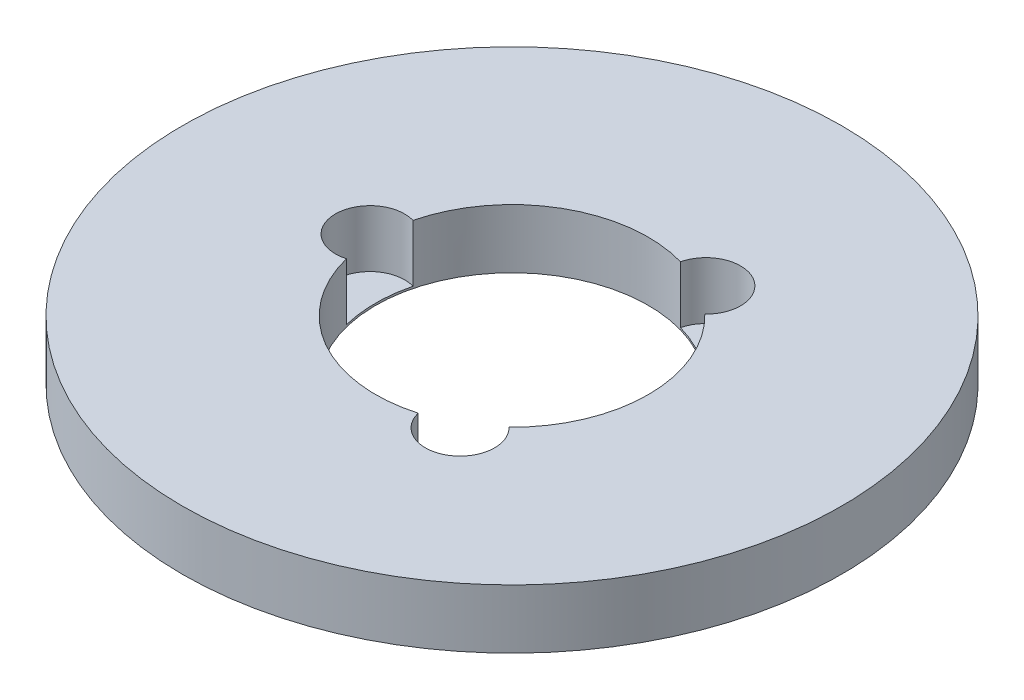
ISO-10303-21;
HEADER;
FILE_DESCRIPTION(('STEP AP214'),'2;1');
FILE_NAME('part.step','',(''),(''),'','','');
FILE_SCHEMA(('AUTOMOTIVE_DESIGN { 1 0 10303 214 1 1 1 1 }'));
ENDSEC;
DATA;
#1=APPLICATION_CONTEXT('core data for automotive mechanical design processes');
#2=APPLICATION_PROTOCOL_DEFINITION('international standard','automotive_design',2000,#1);
#3=PRODUCT_CONTEXT('',#1,'mechanical');
#4=PRODUCT('Part','Part','',(#3));
#5=PRODUCT_RELATED_PRODUCT_CATEGORY('part','',(#4));
#6=PRODUCT_DEFINITION_FORMATION('','',#4);
#7=PRODUCT_DEFINITION_CONTEXT('part definition',#1,'design');
#8=PRODUCT_DEFINITION('design','',#6,#7);
#9=PRODUCT_DEFINITION_SHAPE('','',#8);
#10=(LENGTH_UNIT() NAMED_UNIT(*) SI_UNIT(.MILLI.,.METRE.));
#11=(NAMED_UNIT(*) PLANE_ANGLE_UNIT() SI_UNIT($,.RADIAN.));
#12=(NAMED_UNIT(*) SI_UNIT($,.STERADIAN.) SOLID_ANGLE_UNIT());
#13=UNCERTAINTY_MEASURE_WITH_UNIT(LENGTH_MEASURE(1.E-05),#10,'distance_accuracy_value','');
#14=(GEOMETRIC_REPRESENTATION_CONTEXT(3) GLOBAL_UNCERTAINTY_ASSIGNED_CONTEXT((#13)) GLOBAL_UNIT_ASSIGNED_CONTEXT((#10,
#11,#12)) REPRESENTATION_CONTEXT('',''));
#15=CARTESIAN_POINT('',(0.,0.,0.));
#16=DIRECTION('',(0.,0.,1.));
#17=DIRECTION('',(1.,0.,0.));
#18=AXIS2_PLACEMENT_3D('',#15,#16,#17);
#19=CARTESIAN_POINT('',(0.,13.,0.));
#20=DIRECTION('',(0.,-1.,0.));
#21=DIRECTION('',(0.,0.,-1.));
#22=AXIS2_PLACEMENT_3D('',#19,#20,#21);
#23=CYLINDRICAL_SURFACE('',#22,72.5);
#24=CARTESIAN_POINT('',(0.,13.,0.));
#25=DIRECTION('',(0.,1.,0.));
#26=DIRECTION('',(0.,0.,1.));
#27=AXIS2_PLACEMENT_3D('',#24,#25,#26);
#28=CIRCLE('',#27,72.5);
#29=CARTESIAN_POINT('',(0.,13.,-72.5));
#30=VERTEX_POINT('',#29);
#31=EDGE_CURVE('E126',#30,#30,#28,.T.);
#32=CARTESIAN_POINT('',(0.,0.,0.));
#33=DIRECTION('',(0.,1.,0.));
#34=DIRECTION('',(0.,0.,1.));
#35=AXIS2_PLACEMENT_3D('',#32,#33,#34);
#36=CIRCLE('',#35,72.5);
#37=CARTESIAN_POINT('',(0.,0.,-72.5));
#38=VERTEX_POINT('',#37);
#39=EDGE_CURVE('E124',#38,#38,#36,.T.);
#40=CARTESIAN_POINT('',(0.,13.,-72.5));
#41=CARTESIAN_POINT('',(0.,12.8645833333333,-72.5));
#42=CARTESIAN_POINT('',(0.,12.7291666666667,-72.5));
#43=CARTESIAN_POINT('',(0.,12.4583333333333,-72.5));
#44=CARTESIAN_POINT('',(0.,12.3229166666667,-72.5));
#45=CARTESIAN_POINT('',(0.,12.0520833333333,-72.5));
#46=CARTESIAN_POINT('',(0.,11.9166666666667,-72.5));
#47=CARTESIAN_POINT('',(0.,11.6458333333333,-72.5));
#48=CARTESIAN_POINT('',(0.,11.5104166666667,-72.5));
#49=CARTESIAN_POINT('',(0.,11.2395833333333,-72.5));
#50=CARTESIAN_POINT('',(0.,11.1041666666667,-72.5));
#51=CARTESIAN_POINT('',(0.,10.8333333333333,-72.5));
#52=CARTESIAN_POINT('',(0.,10.6979166666667,-72.5));
#53=CARTESIAN_POINT('',(0.,10.4270833333333,-72.5));
#54=CARTESIAN_POINT('',(0.,10.2916666666667,-72.5));
#55=CARTESIAN_POINT('',(0.,10.0208333333333,-72.5));
#56=CARTESIAN_POINT('',(0.,9.88541666666667,-72.5));
#57=CARTESIAN_POINT('',(0.,9.61458333333333,-72.5));
#58=CARTESIAN_POINT('',(0.,9.47916666666667,-72.5));
#59=CARTESIAN_POINT('',(0.,9.20833333333333,-72.5));
#60=CARTESIAN_POINT('',(0.,9.07291666666666,-72.5));
#61=CARTESIAN_POINT('',(0.,8.80208333333333,-72.5));
#62=CARTESIAN_POINT('',(0.,8.66666666666667,-72.5));
#63=CARTESIAN_POINT('',(0.,8.39583333333333,-72.5));
#64=CARTESIAN_POINT('',(0.,8.26041666666667,-72.5));
#65=CARTESIAN_POINT('',(0.,7.98958333333333,-72.5));
#66=CARTESIAN_POINT('',(0.,7.85416666666667,-72.5));
#67=CARTESIAN_POINT('',(0.,7.58333333333333,-72.5));
#68=CARTESIAN_POINT('',(0.,7.44791666666667,-72.5));
#69=CARTESIAN_POINT('',(0.,7.17708333333333,-72.5));
#70=CARTESIAN_POINT('',(0.,7.04166666666667,-72.5));
#71=CARTESIAN_POINT('',(0.,6.77083333333333,-72.5));
#72=CARTESIAN_POINT('',(0.,6.63541666666667,-72.5));
#73=CARTESIAN_POINT('',(0.,6.36458333333333,-72.5));
#74=CARTESIAN_POINT('',(0.,6.22916666666667,-72.5));
#75=CARTESIAN_POINT('',(0.,5.95833333333333,-72.5));
#76=CARTESIAN_POINT('',(0.,5.82291666666667,-72.5));
#77=CARTESIAN_POINT('',(0.,5.55208333333333,-72.5));
#78=CARTESIAN_POINT('',(0.,5.41666666666667,-72.5));
#79=CARTESIAN_POINT('',(0.,5.14583333333333,-72.5));
#80=CARTESIAN_POINT('',(0.,5.01041666666667,-72.5));
#81=CARTESIAN_POINT('',(0.,4.73958333333333,-72.5));
#82=CARTESIAN_POINT('',(0.,4.60416666666667,-72.5));
#83=CARTESIAN_POINT('',(0.,4.33333333333333,-72.5));
#84=CARTESIAN_POINT('',(0.,4.19791666666667,-72.5));
#85=CARTESIAN_POINT('',(0.,3.92708333333333,-72.5));
#86=CARTESIAN_POINT('',(0.,3.79166666666667,-72.5));
#87=CARTESIAN_POINT('',(0.,3.52083333333333,-72.5));
#88=CARTESIAN_POINT('',(0.,3.38541666666667,-72.5));
#89=CARTESIAN_POINT('',(0.,3.11458333333333,-72.5));
#90=CARTESIAN_POINT('',(0.,2.97916666666667,-72.5));
#91=CARTESIAN_POINT('',(0.,2.70833333333333,-72.5));
#92=CARTESIAN_POINT('',(0.,2.57291666666667,-72.5));
#93=CARTESIAN_POINT('',(0.,2.30208333333333,-72.5));
#94=CARTESIAN_POINT('',(0.,2.16666666666667,-72.5));
#95=CARTESIAN_POINT('',(0.,1.89583333333333,-72.5));
#96=CARTESIAN_POINT('',(0.,1.76041666666667,-72.5));
#97=CARTESIAN_POINT('',(0.,1.48958333333333,-72.5));
#98=CARTESIAN_POINT('',(0.,1.35416666666667,-72.5));
#99=CARTESIAN_POINT('',(0.,1.08333333333333,-72.5));
#100=CARTESIAN_POINT('',(0.,0.947916666666667,-72.5));
#101=CARTESIAN_POINT('',(0.,0.677083333333334,-72.5));
#102=CARTESIAN_POINT('',(0.,0.541666666666667,-72.5));
#103=CARTESIAN_POINT('',(0.,0.270833333333334,-72.5));
#104=CARTESIAN_POINT('',(0.,0.135416666666667,-72.5));
#105=CARTESIAN_POINT('',(0.,0.,-72.5));
#106=B_SPLINE_CURVE_WITH_KNOTS('',3,(#40,#41,#42,#43,#44,#45,#46,#47,#48,#49,#50,#51,#52,#53,
#54,#55,#56,#57,#58,#59,#60,#61,#62,#63,#64,#65,#66,#67,#68,#69,#70,#71,#72,#73,#74,#75,#76,#77,
#78,#79,#80,#81,#82,#83,#84,#85,#86,#87,#88,#89,#90,#91,#92,#93,#94,#95,#96,#97,#98,#99,#100,
#101,#102,#103,#104,#105),.UNSPECIFIED.,.F.,.F.,(4,2,2,2,2,2,2,2,2,2,2,2,2,2,2,2,2,2,2,2,2,2,2,
2,2,2,2,2,2,2,2,2,4),(0.,0.40625,0.812500000000001,1.21875,1.625,2.03125,2.4375,2.84375,3.25,
3.65625,4.0625,4.46875,4.875,5.28125,5.6875,6.09375,6.5,6.90625,7.3125,7.71875,8.125,8.53125,
8.9375,9.34375,9.75,10.15625,10.5625,10.96875,11.375,11.78125,12.1875,12.59375,13.),.UNSPECIFIED.);
#107=EDGE_CURVE('BSEAM39',#30,#38,#106,.T.);
#108=ORIENTED_EDGE('',*,*,#31,.F.);
#109=ORIENTED_EDGE('',*,*,#39,.T.);
#110=ORIENTED_EDGE('',*,*,#107,.T.);
#111=ORIENTED_EDGE('',*,*,#107,.F.);
#112=EDGE_LOOP('',(#108,#110,#109,#111));
#113=FACE_BOUND('',#112,.T.);
#114=ADVANCED_FACE('F39',(#113),#23,.T.);
#115=CARTESIAN_POINT('',(0.,13.,0.));
#116=DIRECTION('',(0.,1.,0.));
#117=DIRECTION('',(0.,0.,1.));
#118=AXIS2_PLACEMENT_3D('',#115,#116,#117);
#119=PLANE('',#118);
#120=CARTESIAN_POINT('',(15.6173249835945,13.,27.0500003499002));
#121=DIRECTION('',(0.,1.,0.));
#122=DIRECTION('',(0.866025403784436,0.,-0.500000000000004));
#123=AXIS2_PLACEMENT_3D('',#120,#121,#122);
#124=CIRCLE('',#123,7.61875199056458);
#125=CARTESIAN_POINT('',(8.21506166700233,13.,28.8532972432502));
#126=VERTEX_POINT('',#125);
#127=CARTESIAN_POINT('',(20.8801575620972,13.,21.5411007189047));
#128=VERTEX_POINT('',#127);
#129=EDGE_CURVE('E147',#126,#128,#124,.T.);
#130=ORIENTED_EDGE('',*,*,#129,.F.);
#131=CARTESIAN_POINT('',(0.,13.,0.));
#132=DIRECTION('',(0.,1.,0.));
#133=DIRECTION('',(0.,0.,1.));
#134=AXIS2_PLACEMENT_3D('',#131,#132,#133);
#135=CIRCLE('',#134,30.);
#136=CARTESIAN_POINT('',(-29.0952192290993,13.,7.31219652434547));
#137=VERTEX_POINT('',#136);
#138=EDGE_CURVE('E118',#137,#126,#135,.T.);
#139=ORIENTED_EDGE('',*,*,#138,.F.);
#140=CARTESIAN_POINT('',(-31.2346499671887,13.,0.));
#141=DIRECTION('',(0.,1.,0.));
#142=DIRECTION('',(0.,0.,1.));
#143=AXIS2_PLACEMENT_3D('',#140,#141,#142);
#144=CIRCLE('',#143,7.61875199056458);
#145=CARTESIAN_POINT('',(-29.0952192290993,13.,-7.31219652434547));
#146=VERTEX_POINT('',#145);
#147=EDGE_CURVE('E113',#146,#137,#144,.T.);
#148=ORIENTED_EDGE('',*,*,#147,.F.);
#149=CARTESIAN_POINT('',(8.21506166700193,13.,-28.8532972432503));
#150=VERTEX_POINT('',#149);
#151=EDGE_CURVE('E106',#150,#146,#135,.T.);
#152=ORIENTED_EDGE('',*,*,#151,.F.);
#153=CARTESIAN_POINT('',(15.6173249835941,13.,-27.0500003499004));
#154=DIRECTION('',(0.,1.,0.));
#155=DIRECTION('',(-0.866025403784443,0.,-0.499999999999992));
#156=AXIS2_PLACEMENT_3D('',#153,#154,#155);
#157=CIRCLE('',#156,7.61875199056458);
#158=CARTESIAN_POINT('',(20.8801575620969,13.,-21.5411007189049));
#159=VERTEX_POINT('',#158);
#160=EDGE_CURVE('E90',#159,#150,#157,.T.);
#161=ORIENTED_EDGE('',*,*,#160,.F.);
#162=EDGE_CURVE('E116',#128,#159,#135,.T.);
#163=ORIENTED_EDGE('',*,*,#162,.F.);
#164=EDGE_LOOP('',(#130,#139,#148,#152,#161,#163));
#165=FACE_BOUND('',#164,.T.);
#166=ORIENTED_EDGE('',*,*,#31,.T.);
#167=EDGE_LOOP('',(#166));
#168=FACE_BOUND('',#167,.T.);
#169=ADVANCED_FACE('F115',(#165,#168),#119,.T.);
#170=CARTESIAN_POINT('',(0.,0.,0.));
#171=DIRECTION('',(0.,1.,0.));
#172=DIRECTION('',(0.,0.,1.));
#173=AXIS2_PLACEMENT_3D('',#170,#171,#172);
#174=PLANE('',#173);
#175=CARTESIAN_POINT('',(0.,0.,0.));
#176=DIRECTION('',(0.,1.,0.));
#177=DIRECTION('',(0.,0.,1.));
#178=AXIS2_PLACEMENT_3D('',#175,#176,#177);
#179=CIRCLE('',#178,30.);
#180=CARTESIAN_POINT('',(0.,0.,30.));
#181=VERTEX_POINT('',#180);
#182=EDGE_CURVE('E120',#181,#181,#179,.T.);
#183=ORIENTED_EDGE('',*,*,#182,.T.);
#184=EDGE_LOOP('',(#183));
#185=FACE_BOUND('',#184,.T.);
#186=ORIENTED_EDGE('',*,*,#39,.F.);
#187=EDGE_LOOP('',(#186));
#188=FACE_BOUND('',#187,.T.);
#189=ADVANCED_FACE('F164',(#185,#188),#174,.F.);
#190=CARTESIAN_POINT('',(0.,13.,0.));
#191=DIRECTION('',(0.,-1.,0.));
#192=DIRECTION('',(0.,0.,-1.));
#193=AXIS2_PLACEMENT_3D('',#190,#191,#192);
#194=CYLINDRICAL_SURFACE('',#193,30.);
#195=DIRECTION('',(0.,1.,0.));
#196=VECTOR('',#195,1.);
#197=CARTESIAN_POINT('',(8.21506166700233,6.721675231478,28.8532972432502));
#198=LINE('',#197,#196);
#199=CARTESIAN_POINT('',(8.21506166700233,0.443350462956009,28.8532972432502));
#200=VERTEX_POINT('',#199);
#201=EDGE_CURVE('E11',#200,#126,#198,.T.);
#202=ORIENTED_EDGE('',*,*,#201,.F.);
#203=CARTESIAN_POINT('',(0.,0.443350462956009,0.));
#204=DIRECTION('',(0.,1.,0.));
#205=DIRECTION('',(0.,0.,1.));
#206=AXIS2_PLACEMENT_3D('',#203,#204,#205);
#207=CIRCLE('',#206,30.);
#208=CARTESIAN_POINT('',(20.8801575620972,0.443350462956009,21.5411007189047));
#209=VERTEX_POINT('',#208);
#210=EDGE_CURVE('E144',#200,#209,#207,.T.);
#211=ORIENTED_EDGE('',*,*,#210,.T.);
#212=DIRECTION('',(0.,1.,0.));
#213=VECTOR('',#212,1.);
#214=CARTESIAN_POINT('',(20.8801575620972,6.721675231478,21.5411007189047));
#215=LINE('',#214,#213);
#216=EDGE_CURVE('E46',#128,#209,#215,.F.);
#217=ORIENTED_EDGE('',*,*,#216,.F.);
#218=ORIENTED_EDGE('',*,*,#162,.T.);
#219=DIRECTION('',(0.,1.,0.));
#220=VECTOR('',#219,1.);
#221=CARTESIAN_POINT('',(20.8801575620969,6.721675231478,-21.5411007189049));
#222=LINE('',#221,#220);
#223=CARTESIAN_POINT('',(20.8801575620969,0.443350462956009,-21.5411007189049));
#224=VERTEX_POINT('',#223);
#225=EDGE_CURVE('E92',#224,#159,#222,.T.);
#226=ORIENTED_EDGE('',*,*,#225,.F.);
#227=CARTESIAN_POINT('',(0.,0.443350462956009,0.));
#228=DIRECTION('',(0.,1.,0.));
#229=DIRECTION('',(0.,0.,1.));
#230=AXIS2_PLACEMENT_3D('',#227,#228,#229);
#231=CIRCLE('',#230,30.);
#232=CARTESIAN_POINT('',(8.21506166700193,0.443350462956009,-28.8532972432503));
#233=VERTEX_POINT('',#232);
#234=EDGE_CURVE('E107',#224,#233,#231,.T.);
#235=ORIENTED_EDGE('',*,*,#234,.T.);
#236=DIRECTION('',(0.,1.,0.));
#237=VECTOR('',#236,1.);
#238=CARTESIAN_POINT('',(8.21506166700193,6.721675231478,-28.8532972432503));
#239=LINE('',#238,#237);
#240=EDGE_CURVE('E95',#150,#233,#239,.F.);
#241=ORIENTED_EDGE('',*,*,#240,.F.);
#242=ORIENTED_EDGE('',*,*,#151,.T.);
#243=DIRECTION('',(0.,1.,0.));
#244=VECTOR('',#243,1.);
#245=CARTESIAN_POINT('',(-29.0952192290993,6.721675231478,-7.31219652434547));
#246=LINE('',#245,#244);
#247=CARTESIAN_POINT('',(-29.0952192290993,0.443350462956009,-7.31219652434547));
#248=VERTEX_POINT('',#247);
#249=EDGE_CURVE('E143',#248,#146,#246,.T.);
#250=ORIENTED_EDGE('',*,*,#249,.F.);
#251=CARTESIAN_POINT('',(0.,0.443350462956009,0.));
#252=DIRECTION('',(0.,1.,0.));
#253=DIRECTION('',(0.,0.,1.));
#254=AXIS2_PLACEMENT_3D('',#251,#252,#253);
#255=CIRCLE('',#254,30.);
#256=CARTESIAN_POINT('',(-29.0952192290993,0.443350462956009,7.31219652434547));
#257=VERTEX_POINT('',#256);
#258=EDGE_CURVE('E132',#248,#257,#255,.T.);
#259=ORIENTED_EDGE('',*,*,#258,.T.);
#260=DIRECTION('',(0.,1.,0.));
#261=VECTOR('',#260,1.);
#262=CARTESIAN_POINT('',(-29.0952192290993,6.721675231478,7.31219652434547));
#263=LINE('',#262,#261);
#264=EDGE_CURVE('E137',#137,#257,#263,.F.);
#265=ORIENTED_EDGE('',*,*,#264,.F.);
#266=ORIENTED_EDGE('',*,*,#138,.T.);
#267=EDGE_LOOP('',(#202,#211,#217,#218,#226,#235,#241,#242,#250,#259,#265,#266));
#268=FACE_BOUND('',#267,.T.);
#269=ORIENTED_EDGE('',*,*,#182,.F.);
#270=EDGE_LOOP('',(#269));
#271=FACE_BOUND('',#270,.T.);
#272=ADVANCED_FACE('F103',(#268,#271),#194,.F.);
#273=CARTESIAN_POINT('',(-31.2346499671887,0.443350462956009,0.));
#274=DIRECTION('',(0.,1.,0.));
#275=DIRECTION('',(0.,0.,1.));
#276=AXIS2_PLACEMENT_3D('',#273,#274,#275);
#277=CYLINDRICAL_SURFACE('',#276,7.61875199056458);
#278=ORIENTED_EDGE('',*,*,#249,.T.);
#279=ORIENTED_EDGE('',*,*,#147,.T.);
#280=ORIENTED_EDGE('',*,*,#264,.T.);
#281=CARTESIAN_POINT('',(-31.2346499671887,0.443350462956009,0.));
#282=DIRECTION('',(0.,1.,0.));
#283=DIRECTION('',(0.,0.,1.));
#284=AXIS2_PLACEMENT_3D('',#281,#282,#283);
#285=CIRCLE('',#284,7.61875199056458);
#286=EDGE_CURVE('E121',#248,#257,#285,.T.);
#287=ORIENTED_EDGE('',*,*,#286,.F.);
#288=EDGE_LOOP('',(#278,#279,#280,#287));
#289=FACE_BOUND('',#288,.T.);
#290=ADVANCED_FACE('F174',(#289),#277,.F.);
#291=CARTESIAN_POINT('',(-31.2346499671887,0.443350462956009,0.));
#292=DIRECTION('',(0.,1.,0.));
#293=DIRECTION('',(0.,0.,1.));
#294=AXIS2_PLACEMENT_3D('',#291,#292,#293);
#295=PLANE('',#294);
#296=ORIENTED_EDGE('',*,*,#286,.T.);
#297=ORIENTED_EDGE('',*,*,#258,.F.);
#298=EDGE_LOOP('',(#296,#297));
#299=FACE_BOUND('',#298,.T.);
#300=ADVANCED_FACE('F177',(#299),#295,.T.);
#301=CARTESIAN_POINT('',(15.6173249835941,0.443350462956009,-27.0500003499004));
#302=DIRECTION('',(0.,1.,0.));
#303=DIRECTION('',(0.,0.,1.));
#304=AXIS2_PLACEMENT_3D('',#301,#302,#303);
#305=CYLINDRICAL_SURFACE('',#304,7.61875199056458);
#306=ORIENTED_EDGE('',*,*,#225,.T.);
#307=ORIENTED_EDGE('',*,*,#160,.T.);
#308=ORIENTED_EDGE('',*,*,#240,.T.);
#309=CARTESIAN_POINT('',(15.6173249835941,0.443350462956009,-27.0500003499004));
#310=DIRECTION('',(0.,1.,0.));
#311=DIRECTION('',(-0.866025403784443,0.,-0.499999999999992));
#312=AXIS2_PLACEMENT_3D('',#309,#310,#311);
#313=CIRCLE('',#312,7.61875199056458);
#314=EDGE_CURVE('E56',#224,#233,#313,.T.);
#315=ORIENTED_EDGE('',*,*,#314,.F.);
#316=EDGE_LOOP('',(#306,#307,#308,#315));
#317=FACE_BOUND('',#316,.T.);
#318=ADVANCED_FACE('F93',(#317),#305,.F.);
#319=CARTESIAN_POINT('',(15.6173249835941,0.443350462956009,-27.0500003499004));
#320=DIRECTION('',(0.,1.,0.));
#321=DIRECTION('',(-0.866025403784443,0.,-0.499999999999992));
#322=AXIS2_PLACEMENT_3D('',#319,#320,#321);
#323=PLANE('',#322);
#324=ORIENTED_EDGE('',*,*,#314,.T.);
#325=ORIENTED_EDGE('',*,*,#234,.F.);
#326=EDGE_LOOP('',(#324,#325));
#327=FACE_BOUND('',#326,.T.);
#328=ADVANCED_FACE('F160',(#327),#323,.T.);
#329=CARTESIAN_POINT('',(15.6173249835945,0.443350462956009,27.0500003499002));
#330=DIRECTION('',(0.,1.,0.));
#331=DIRECTION('',(0.,0.,1.));
#332=AXIS2_PLACEMENT_3D('',#329,#330,#331);
#333=CYLINDRICAL_SURFACE('',#332,7.61875199056458);
#334=ORIENTED_EDGE('',*,*,#201,.T.);
#335=ORIENTED_EDGE('',*,*,#129,.T.);
#336=ORIENTED_EDGE('',*,*,#216,.T.);
#337=CARTESIAN_POINT('',(15.6173249835945,0.443350462956009,27.0500003499002));
#338=DIRECTION('',(0.,1.,0.));
#339=DIRECTION('',(0.866025403784436,0.,-0.500000000000004));
#340=AXIS2_PLACEMENT_3D('',#337,#338,#339);
#341=CIRCLE('',#340,7.61875199056458);
#342=EDGE_CURVE('E55',#200,#209,#341,.T.);
#343=ORIENTED_EDGE('',*,*,#342,.F.);
#344=EDGE_LOOP('',(#334,#335,#336,#343));
#345=FACE_BOUND('',#344,.T.);
#346=ADVANCED_FACE('F149',(#345),#333,.F.);
#347=CARTESIAN_POINT('',(15.6173249835945,0.443350462956009,27.0500003499002));
#348=DIRECTION('',(0.,1.,0.));
#349=DIRECTION('',(0.866025403784436,0.,-0.500000000000004));
#350=AXIS2_PLACEMENT_3D('',#347,#348,#349);
#351=PLANE('',#350);
#352=ORIENTED_EDGE('',*,*,#342,.T.);
#353=ORIENTED_EDGE('',*,*,#210,.F.);
#354=EDGE_LOOP('',(#352,#353));
#355=FACE_BOUND('',#354,.T.);
#356=ADVANCED_FACE('F151',(#355),#351,.T.);
#357=CLOSED_SHELL('',(#114,#169,#189,#272,#290,#300,#318,#328,#346,#356));
#358=MANIFOLD_SOLID_BREP('B2',#357);
#359=ADVANCED_BREP_SHAPE_REPRESENTATION('',(#18,#358),#14);
#360=SHAPE_DEFINITION_REPRESENTATION(#9,#359);
ENDSEC;
END-ISO-10303-21;
